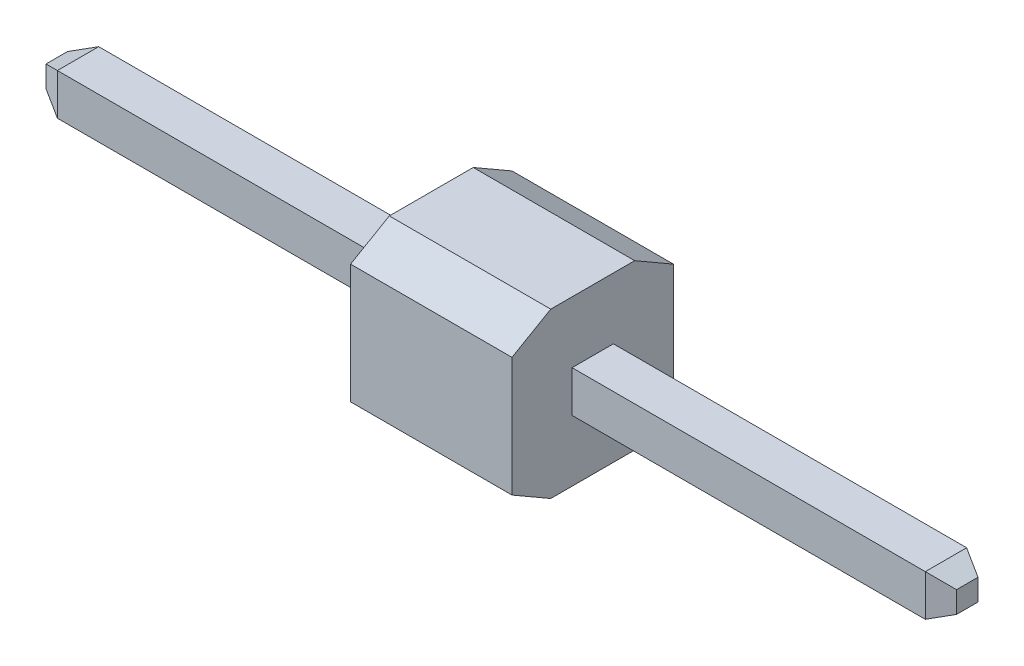
ISO-10303-21;
HEADER;
FILE_DESCRIPTION(('STEP AP214'),'2;1');
FILE_NAME('part.step','',(''),(''),'','','');
FILE_SCHEMA(('AUTOMOTIVE_DESIGN { 1 0 10303 214 1 1 1 1 }'));
ENDSEC;
DATA;
#1=APPLICATION_CONTEXT('core data for automotive mechanical design processes');
#2=APPLICATION_PROTOCOL_DEFINITION('international standard','automotive_design',2000,#1);
#3=PRODUCT_CONTEXT('',#1,'mechanical');
#4=PRODUCT('Part','Part','',(#3));
#5=PRODUCT_RELATED_PRODUCT_CATEGORY('part','',(#4));
#6=PRODUCT_DEFINITION_FORMATION('','',#4);
#7=PRODUCT_DEFINITION_CONTEXT('part definition',#1,'design');
#8=PRODUCT_DEFINITION('design','',#6,#7);
#9=PRODUCT_DEFINITION_SHAPE('','',#8);
#10=(LENGTH_UNIT() NAMED_UNIT(*) SI_UNIT(.MILLI.,.METRE.));
#11=(NAMED_UNIT(*) PLANE_ANGLE_UNIT() SI_UNIT($,.RADIAN.));
#12=(NAMED_UNIT(*) SI_UNIT($,.STERADIAN.) SOLID_ANGLE_UNIT());
#13=UNCERTAINTY_MEASURE_WITH_UNIT(LENGTH_MEASURE(1.E-05),#10,'distance_accuracy_value','');
#14=(GEOMETRIC_REPRESENTATION_CONTEXT(3) GLOBAL_UNCERTAINTY_ASSIGNED_CONTEXT((#13)) GLOBAL_UNIT_ASSIGNED_CONTEXT((#10,
#11,#12)) REPRESENTATION_CONTEXT('',''));
#15=CARTESIAN_POINT('',(0.,0.,0.));
#16=DIRECTION('',(0.,0.,1.));
#17=DIRECTION('',(1.,0.,0.));
#18=AXIS2_PLACEMENT_3D('',#15,#16,#17);
#19=CARTESIAN_POINT('',(5.42110145703109,10.4771157260571,-2.77112148378018));
#20=DIRECTION('',(1.,-9.93476518829084E-08,4.37113882867379E-08));
#21=DIRECTION('',(-9.93476589883358E-08,-1.,8.74227765734759E-08));
#22=AXIS2_PLACEMENT_3D('',#19,#20,#21);
#23=PLANE('',#22);
#24=DIRECTION('',(-1.18186619959584E-08,-0.50000007571054,-0.866025360072934));
#25=VECTOR('',#24,1.);
#26=CARTESIAN_POINT('',(5.42110126485648,9.23352602482091,-1.2011213750621));
#27=LINE('',#26,#25);
#28=CARTESIAN_POINT('',(5.42110126485648,9.23352602482091,-1.2011213750621));
#29=VERTEX_POINT('',#28);
#30=CARTESIAN_POINT('',(5.42110125666827,8.88711581085724,-1.80112134477796));
#31=VERTEX_POINT('',#30);
#32=EDGE_CURVE('E11',#29,#31,#27,.T.);
#33=ORIENTED_EDGE('',*,*,#32,.T.);
#34=DIRECTION('',(4.37113811813104E-08,-8.74227842254741E-08,-0.999999999999995));
#35=VECTOR('',#34,1.);
#36=CARTESIAN_POINT('',(5.42110125666827,8.88711581085724,-1.80112134477796));
#37=LINE('',#36,#35);
#38=CARTESIAN_POINT('',(5.42110131349307,8.88711569720762,-3.10112134477796));
#39=VERTEX_POINT('',#38);
#40=EDGE_CURVE('E304',#31,#39,#37,.T.);
#41=ORIENTED_EDGE('',*,*,#40,.T.);
#42=DIRECTION('',(8.75289950712042E-08,0.499999924289839,-0.866025447495712));
#43=VECTOR('',#42,1.);
#44=CARTESIAN_POINT('',(5.42110131349307,8.88711569720762,-3.10112134477796));
#45=LINE('',#44,#43);
#46=CARTESIAN_POINT('',(5.42110137413493,9.23352580626395,-3.7011213750621));
#47=VERTEX_POINT('',#46);
#48=EDGE_CURVE('E296',#39,#47,#45,.T.);
#49=ORIENTED_EDGE('',*,*,#48,.T.);
#50=DIRECTION('',(9.93476593244772E-08,0.999999999999991,-8.74227767226935E-08));
#51=VECTOR('',#50,1.);
#52=CARTESIAN_POINT('',(5.42110137413493,9.23352580626395,-3.7011213750621));
#53=LINE('',#52,#51);
#54=CARTESIAN_POINT('',(5.42110155764791,11.080705483234,-3.70112153654768));
#55=VERTEX_POINT('',#54);
#56=EDGE_CURVE('E281',#47,#55,#53,.T.);
#57=ORIENTED_EDGE('',*,*,#56,.T.);
#58=DIRECTION('',(-1.18186619958732E-08,-0.500000075710534,-0.866025360072937));
#59=VECTOR('',#58,1.);
#60=CARTESIAN_POINT('',(5.42110156583612,11.4271156972076,-3.10112156683181));
#61=LINE('',#60,#59);
#62=CARTESIAN_POINT('',(5.42110156583612,11.4271156972076,-3.10112156683181));
#63=VERTEX_POINT('',#62);
#64=EDGE_CURVE('E265',#63,#55,#61,.T.);
#65=ORIENTED_EDGE('',*,*,#64,.F.);
#66=DIRECTION('',(4.37113811813104E-08,-8.74227842254741E-08,-0.999999999999995));
#67=VECTOR('',#66,1.);
#68=CARTESIAN_POINT('',(5.42110150901132,11.4271158108572,-1.80112156683181));
#69=LINE('',#68,#67);
#70=CARTESIAN_POINT('',(5.42110150901132,11.4271158108572,-1.80112156683181));
#71=VERTEX_POINT('',#70);
#72=EDGE_CURVE('E248',#71,#63,#69,.T.);
#73=ORIENTED_EDGE('',*,*,#72,.F.);
#74=DIRECTION('',(8.7528995070573E-08,0.499999924289833,-0.866025447495715));
#75=VECTOR('',#74,1.);
#76=CARTESIAN_POINT('',(5.42110144836946,11.0807057017909,-1.20112153654768));
#77=LINE('',#76,#75);
#78=CARTESIAN_POINT('',(5.42110144836946,11.0807057017909,-1.20112153654768));
#79=VERTEX_POINT('',#78);
#80=EDGE_CURVE('E242',#79,#71,#77,.T.);
#81=ORIENTED_EDGE('',*,*,#80,.F.);
#82=DIRECTION('',(9.93476593244772E-08,0.999999999999991,-8.74227763620714E-08));
#83=VECTOR('',#82,1.);
#84=CARTESIAN_POINT('',(5.42110126485648,9.23352602482091,-1.2011213750621));
#85=LINE('',#84,#83);
#86=EDGE_CURVE('E236',#29,#79,#85,.T.);
#87=ORIENTED_EDGE('',*,*,#86,.F.);
#88=EDGE_LOOP('',(#33,#41,#49,#57,#65,#73,#81,#87));
#89=FACE_BOUND('',#88,.T.);
#90=DIRECTION('',(-4.37113803486431E-08,8.74227856773043E-08,0.999999999999995));
#91=VECTOR('',#90,1.);
#92=CARTESIAN_POINT('',(5.42110139344859,9.83711572605714,-2.7711214278296));
#93=LINE('',#92,#91);
#94=CARTESIAN_POINT('',(5.42110139344859,9.83711572605714,-2.7711214278296));
#95=VERTEX_POINT('',#94);
#96=CARTESIAN_POINT('',(5.4211013654733,9.83711578200772,-2.1311214278296));
#97=VERTEX_POINT('',#96);
#98=EDGE_CURVE('E302',#95,#97,#93,.T.);
#99=ORIENTED_EDGE('',*,*,#98,.T.);
#100=DIRECTION('',(-9.93476592658906E-08,-0.999999999999991,8.74227759628524E-08));
#101=VECTOR('',#100,1.);
#102=CARTESIAN_POINT('',(5.4211014290558,10.4771157820077,-2.13112148378018));
#103=LINE('',#102,#101);
#104=CARTESIAN_POINT('',(5.4211014290558,10.4771157820077,-2.13112148378018));
#105=VERTEX_POINT('',#104);
#106=EDGE_CURVE('E293',#105,#97,#103,.T.);
#107=ORIENTED_EDGE('',*,*,#106,.F.);
#108=DIRECTION('',(-4.37113803486431E-08,8.74227856773042E-08,0.999999999999995));
#109=VECTOR('',#108,1.);
#110=CARTESIAN_POINT('',(5.42110145703109,10.4771157260571,-2.77112148378018));
#111=LINE('',#110,#109);
#112=CARTESIAN_POINT('',(5.42110145703109,10.4771157260571,-2.77112148378018));
#113=VERTEX_POINT('',#112);
#114=EDGE_CURVE('E278',#113,#105,#111,.T.);
#115=ORIENTED_EDGE('',*,*,#114,.F.);
#116=DIRECTION('',(-9.93476592658906E-08,-0.999999999999991,8.74227766567418E-08));
#117=VECTOR('',#116,1.);
#118=CARTESIAN_POINT('',(5.42110145703109,10.4771157260571,-2.77112148378018));
#119=LINE('',#118,#117);
#120=EDGE_CURVE('E263',#113,#95,#119,.T.);
#121=ORIENTED_EDGE('',*,*,#120,.T.);
#122=EDGE_LOOP('',(#99,#107,#115,#121));
#123=FACE_BOUND('',#122,.T.);
#124=ADVANCED_FACE('F17',(#89,#123),#23,.T.);
#125=CARTESIAN_POINT('',(2.92110145703109,10.4771159744263,-2.77112159305865));
#126=DIRECTION('',(1.,-9.93476518829084E-08,4.37113882867379E-08));
#127=DIRECTION('',(-9.93476589883358E-08,-1.,8.74227765734759E-08));
#128=AXIS2_PLACEMENT_3D('',#125,#126,#127);
#129=PLANE('',#128);
#130=DIRECTION('',(-1.18186632779335E-08,-0.50000007571054,-0.866025360072934));
#131=VECTOR('',#130,1.);
#132=CARTESIAN_POINT('',(2.92110126485648,9.23352627319004,-1.20112148434057));
#133=LINE('',#132,#131);
#134=CARTESIAN_POINT('',(2.92110126485648,9.23352627319004,-1.20112148434057));
#135=VERTEX_POINT('',#134);
#136=CARTESIAN_POINT('',(2.92110125666827,8.88711605922637,-1.80112145405643));
#137=VERTEX_POINT('',#136);
#138=EDGE_CURVE('E24',#135,#137,#133,.T.);
#139=ORIENTED_EDGE('',*,*,#138,.F.);
#140=DIRECTION('',(9.93476588436478E-08,0.999999999999991,-8.74227763620714E-08));
#141=VECTOR('',#140,1.);
#142=CARTESIAN_POINT('',(2.92110126485648,9.23352627319004,-1.20112148434057));
#143=LINE('',#142,#141);
#144=CARTESIAN_POINT('',(2.92110144836946,11.08070595016,-1.20112164582615));
#145=VERTEX_POINT('',#144);
#146=EDGE_CURVE('E300',#135,#145,#143,.T.);
#147=ORIENTED_EDGE('',*,*,#146,.T.);
#148=DIRECTION('',(8.75289963525482E-08,0.499999924289833,-0.866025447495715));
#149=VECTOR('',#148,1.);
#150=CARTESIAN_POINT('',(2.92110144836946,11.08070595016,-1.20112164582615));
#151=LINE('',#150,#149);
#152=CARTESIAN_POINT('',(2.92110150901132,11.4271160592264,-1.80112167611028));
#153=VERTEX_POINT('',#152);
#154=EDGE_CURVE('E286',#145,#153,#151,.T.);
#155=ORIENTED_EDGE('',*,*,#154,.T.);
#156=DIRECTION('',(4.37113811813104E-08,-8.74227842254741E-08,-0.999999999999995));
#157=VECTOR('',#156,1.);
#158=CARTESIAN_POINT('',(2.92110150901132,11.4271160592264,-1.80112167611028));
#159=LINE('',#158,#157);
#160=CARTESIAN_POINT('',(2.92110156583612,11.4271159455767,-3.10112167611028));
#161=VERTEX_POINT('',#160);
#162=EDGE_CURVE('E271',#153,#161,#159,.T.);
#163=ORIENTED_EDGE('',*,*,#162,.T.);
#164=DIRECTION('',(-1.18186632778483E-08,-0.500000075710534,-0.866025360072937));
#165=VECTOR('',#164,1.);
#166=CARTESIAN_POINT('',(2.92110156583612,11.4271159455767,-3.10112167611028));
#167=LINE('',#166,#165);
#168=CARTESIAN_POINT('',(2.92110155764791,11.0807057316031,-3.70112164582615));
#169=VERTEX_POINT('',#168);
#170=EDGE_CURVE('E253',#161,#169,#167,.T.);
#171=ORIENTED_EDGE('',*,*,#170,.T.);
#172=DIRECTION('',(9.93476588436478E-08,0.999999999999991,-8.74227767226935E-08));
#173=VECTOR('',#172,1.);
#174=CARTESIAN_POINT('',(2.92110137413493,9.23352605463308,-3.70112148434057));
#175=LINE('',#174,#173);
#176=CARTESIAN_POINT('',(2.92110137413493,9.23352605463308,-3.70112148434057));
#177=VERTEX_POINT('',#176);
#178=EDGE_CURVE('E261',#177,#169,#175,.T.);
#179=ORIENTED_EDGE('',*,*,#178,.F.);
#180=DIRECTION('',(8.75289963531793E-08,0.499999924289839,-0.866025447495712));
#181=VECTOR('',#180,1.);
#182=CARTESIAN_POINT('',(2.92110131349307,8.88711594557675,-3.10112145405643));
#183=LINE('',#182,#181);
#184=CARTESIAN_POINT('',(2.92110131349307,8.88711594557675,-3.10112145405643));
#185=VERTEX_POINT('',#184);
#186=EDGE_CURVE('E276',#185,#177,#183,.T.);
#187=ORIENTED_EDGE('',*,*,#186,.F.);
#188=DIRECTION('',(4.37113811813104E-08,-8.74227842254741E-08,-0.999999999999995));
#189=VECTOR('',#188,1.);
#190=CARTESIAN_POINT('',(2.92110125666827,8.88711605922637,-1.80112145405643));
#191=LINE('',#190,#189);
#192=EDGE_CURVE('E291',#137,#185,#191,.T.);
#193=ORIENTED_EDGE('',*,*,#192,.F.);
#194=EDGE_LOOP('',(#139,#147,#155,#163,#171,#179,#187,#193));
#195=FACE_BOUND('',#194,.T.);
#196=DIRECTION('',(-9.93476585720012E-08,-0.999999999999991,8.74227759628524E-08));
#197=VECTOR('',#196,1.);
#198=CARTESIAN_POINT('',(2.9211014290558,10.4771160303769,-2.13112159305865));
#199=LINE('',#198,#197);
#200=CARTESIAN_POINT('',(2.9211014290558,10.4771160303769,-2.13112159305865));
#201=VERTEX_POINT('',#200);
#202=CARTESIAN_POINT('',(2.9211013654733,9.83711603037685,-2.13112153710807));
#203=VERTEX_POINT('',#202);
#204=EDGE_CURVE('E298',#201,#203,#199,.T.);
#205=ORIENTED_EDGE('',*,*,#204,.T.);
#206=DIRECTION('',(-4.37113810425325E-08,8.74227856773043E-08,0.999999999999995));
#207=VECTOR('',#206,1.);
#208=CARTESIAN_POINT('',(2.92110139344859,9.83711597442627,-2.77112153710807));
#209=LINE('',#208,#207);
#210=CARTESIAN_POINT('',(2.92110139344859,9.83711597442627,-2.77112153710807));
#211=VERTEX_POINT('',#210);
#212=EDGE_CURVE('E283',#211,#203,#209,.T.);
#213=ORIENTED_EDGE('',*,*,#212,.F.);
#214=DIRECTION('',(-9.93476585720012E-08,-0.999999999999991,8.74227766567418E-08));
#215=VECTOR('',#214,1.);
#216=CARTESIAN_POINT('',(2.92110145703109,10.4771159744263,-2.77112159305865));
#217=LINE('',#216,#215);
#218=CARTESIAN_POINT('',(2.92110145703109,10.4771159744263,-2.77112159305865));
#219=VERTEX_POINT('',#218);
#220=EDGE_CURVE('E268',#219,#211,#217,.T.);
#221=ORIENTED_EDGE('',*,*,#220,.F.);
#222=DIRECTION('',(-4.37113810425325E-08,8.74227856773042E-08,0.999999999999995));
#223=VECTOR('',#222,1.);
#224=CARTESIAN_POINT('',(2.92110145703109,10.4771159744263,-2.77112159305865));
#225=LINE('',#224,#223);
#226=EDGE_CURVE('E251',#219,#201,#225,.T.);
#227=ORIENTED_EDGE('',*,*,#226,.T.);
#228=EDGE_LOOP('',(#205,#213,#221,#227));
#229=FACE_BOUND('',#228,.T.);
#230=ADVANCED_FACE('F314',(#195,#229),#129,.F.);
#231=CARTESIAN_POINT('',(5.42110126485648,9.23352602482091,-1.2011213750621));
#232=DIRECTION('',(1.07893287081065E-07,0.866025360072937,-0.500000075710535));
#233=DIRECTION('',(1.18186629566715E-08,0.500000075710542,0.866025360072941));
#234=AXIS2_PLACEMENT_3D('',#231,#232,#233);
#235=PLANE('',#234);
#236=ORIENTED_EDGE('',*,*,#138,.T.);
#237=DIRECTION('',(-0.999999999999994,9.93476504618223E-08,-4.37113884643734E-08));
#238=VECTOR('',#237,1.);
#239=CARTESIAN_POINT('',(5.42110125666827,8.88711581085724,-1.80112134477796));
#240=LINE('',#239,#238);
#241=EDGE_CURVE('E288',#31,#137,#240,.T.);
#242=ORIENTED_EDGE('',*,*,#241,.F.);
#243=ORIENTED_EDGE('',*,*,#32,.F.);
#244=DIRECTION('',(-0.999999999999994,9.93476533039933E-08,-4.3711388109102E-08));
#245=VECTOR('',#244,1.);
#246=CARTESIAN_POINT('',(5.42110126485648,9.23352602482091,-1.2011213750621));
#247=LINE('',#246,#245);
#248=EDGE_CURVE('E256',#29,#135,#247,.T.);
#249=ORIENTED_EDGE('',*,*,#248,.T.);
#250=EDGE_LOOP('',(#236,#242,#243,#249));
#251=FACE_BOUND('',#250,.T.);
#252=ADVANCED_FACE('F306',(#251),#235,.F.);
#253=CARTESIAN_POINT('',(5.42110125666827,8.88711581085724,-1.80112134477796));
#254=DIRECTION('',(9.93476589883358E-08,1.,-8.74227765734759E-08));
#255=DIRECTION('',(1.,-9.93476518829084E-08,4.37113882867379E-08));
#256=AXIS2_PLACEMENT_3D('',#253,#254,#255);
#257=PLANE('',#256);
#258=ORIENTED_EDGE('',*,*,#192,.T.);
#259=DIRECTION('',(-0.999999999999994,9.93476504618223E-08,-4.37113882867377E-08));
#260=VECTOR('',#259,1.);
#261=CARTESIAN_POINT('',(5.42110131349307,8.88711569720762,-3.10112134477796));
#262=LINE('',#261,#260);
#263=EDGE_CURVE('E273',#39,#185,#262,.T.);
#264=ORIENTED_EDGE('',*,*,#263,.F.);
#265=ORIENTED_EDGE('',*,*,#40,.F.);
#266=ORIENTED_EDGE('',*,*,#241,.T.);
#267=EDGE_LOOP('',(#258,#264,#265,#266));
#268=FACE_BOUND('',#267,.T.);
#269=ADVANCED_FACE('F311',(#268),#257,.F.);
#270=CARTESIAN_POINT('',(5.42110131349307,8.88711569720762,-3.10112134477796));
#271=DIRECTION('',(6.41819058997377E-08,0.866025447495721,0.499999924289845));
#272=DIRECTION('',(-8.7528996031702E-08,-0.499999924289838,0.866025447495717));
#273=AXIS2_PLACEMENT_3D('',#270,#271,#272);
#274=PLANE('',#273);
#275=ORIENTED_EDGE('',*,*,#186,.T.);
#276=DIRECTION('',(-0.999999999999994,9.93476533039933E-08,-4.37113884643734E-08));
#277=VECTOR('',#276,1.);
#278=CARTESIAN_POINT('',(5.42110137413493,9.23352580626395,-3.7011213750621));
#279=LINE('',#278,#277);
#280=EDGE_CURVE('E258',#47,#177,#279,.T.);
#281=ORIENTED_EDGE('',*,*,#280,.F.);
#282=ORIENTED_EDGE('',*,*,#48,.F.);
#283=ORIENTED_EDGE('',*,*,#263,.T.);
#284=EDGE_LOOP('',(#275,#281,#282,#283));
#285=FACE_BOUND('',#284,.T.);
#286=ADVANCED_FACE('F319',(#285),#274,.F.);
#287=CARTESIAN_POINT('',(5.42110137413493,9.23352580626395,-3.7011213750621));
#288=DIRECTION('',(-4.37113811813106E-08,8.74227836789032E-08,1.));
#289=DIRECTION('',(-1.,9.93476518829084E-08,-4.37113882867379E-08));
#290=AXIS2_PLACEMENT_3D('',#287,#288,#289);
#291=PLANE('',#290);
#292=ORIENTED_EDGE('',*,*,#178,.T.);
#293=DIRECTION('',(-0.999999999999994,9.93476533039933E-08,-4.37113882867377E-08));
#294=VECTOR('',#293,1.);
#295=CARTESIAN_POINT('',(5.42110155764791,11.080705483234,-3.70112153654768));
#296=LINE('',#295,#294);
#297=EDGE_CURVE('E245',#55,#169,#296,.T.);
#298=ORIENTED_EDGE('',*,*,#297,.F.);
#299=ORIENTED_EDGE('',*,*,#56,.F.);
#300=ORIENTED_EDGE('',*,*,#280,.T.);
#301=EDGE_LOOP('',(#292,#298,#299,#300));
#302=FACE_BOUND('',#301,.T.);
#303=ADVANCED_FACE('F326',(#302),#291,.F.);
#304=CARTESIAN_POINT('',(5.42110156583612,11.4271156972076,-3.10112156683181));
#305=DIRECTION('',(1.07893287081065E-07,0.866025360072937,-0.500000075710535));
#306=DIRECTION('',(1.18186629566715E-08,0.500000075710542,0.866025360072941));
#307=AXIS2_PLACEMENT_3D('',#304,#305,#306);
#308=PLANE('',#307);
#309=ORIENTED_EDGE('',*,*,#170,.F.);
#310=DIRECTION('',(-0.999999999999994,9.93476533039933E-08,-4.37113884643734E-08));
#311=VECTOR('',#310,1.);
#312=CARTESIAN_POINT('',(5.42110156583612,11.4271156972076,-3.10112156683181));
#313=LINE('',#312,#311);
#314=EDGE_CURVE('E239',#63,#161,#313,.T.);
#315=ORIENTED_EDGE('',*,*,#314,.F.);
#316=ORIENTED_EDGE('',*,*,#64,.T.);
#317=ORIENTED_EDGE('',*,*,#297,.T.);
#318=EDGE_LOOP('',(#309,#315,#316,#317));
#319=FACE_BOUND('',#318,.T.);
#320=ADVANCED_FACE('F329',(#319),#308,.T.);
#321=CARTESIAN_POINT('',(5.42110150901132,11.4271158108572,-1.80112156683181));
#322=DIRECTION('',(9.93476589883358E-08,1.,-8.74227765734759E-08));
#323=DIRECTION('',(1.,-9.93476518829084E-08,4.37113882867379E-08));
#324=AXIS2_PLACEMENT_3D('',#321,#322,#323);
#325=PLANE('',#324);
#326=ORIENTED_EDGE('',*,*,#162,.F.);
#327=DIRECTION('',(-0.999999999999994,9.93476533039933E-08,-4.37113883755555E-08));
#328=VECTOR('',#327,1.);
#329=CARTESIAN_POINT('',(5.42110150901132,11.4271158108572,-1.80112156683181));
#330=LINE('',#329,#328);
#331=EDGE_CURVE('E233',#71,#153,#330,.T.);
#332=ORIENTED_EDGE('',*,*,#331,.F.);
#333=ORIENTED_EDGE('',*,*,#72,.T.);
#334=ORIENTED_EDGE('',*,*,#314,.T.);
#335=EDGE_LOOP('',(#326,#332,#333,#334));
#336=FACE_BOUND('',#335,.T.);
#337=ADVANCED_FACE('F333',(#336),#325,.T.);
#338=CARTESIAN_POINT('',(5.42110144836946,11.0807057017909,-1.20112153654768));
#339=DIRECTION('',(6.41819058997377E-08,0.866025447495721,0.499999924289845));
#340=DIRECTION('',(-8.7528996031702E-08,-0.499999924289838,0.866025447495717));
#341=AXIS2_PLACEMENT_3D('',#338,#339,#340);
#342=PLANE('',#341);
#343=ORIENTED_EDGE('',*,*,#154,.F.);
#344=DIRECTION('',(-0.999999999999994,9.93476533039933E-08,-4.3711388109102E-08));
#345=VECTOR('',#344,1.);
#346=CARTESIAN_POINT('',(5.42110144836946,11.0807057017909,-1.20112153654768));
#347=LINE('',#346,#345);
#348=EDGE_CURVE('E230',#79,#145,#347,.T.);
#349=ORIENTED_EDGE('',*,*,#348,.F.);
#350=ORIENTED_EDGE('',*,*,#80,.T.);
#351=ORIENTED_EDGE('',*,*,#331,.T.);
#352=EDGE_LOOP('',(#343,#349,#350,#351));
#353=FACE_BOUND('',#352,.T.);
#354=ADVANCED_FACE('F337',(#353),#342,.T.);
#355=CARTESIAN_POINT('',(5.42110126485648,9.23352602482091,-1.2011213750621));
#356=DIRECTION('',(-4.37113811813106E-08,8.74227835615132E-08,1.));
#357=DIRECTION('',(-9.93476589883358E-08,-1.,8.74227764560859E-08));
#358=AXIS2_PLACEMENT_3D('',#355,#356,#357);
#359=PLANE('',#358);
#360=ORIENTED_EDGE('',*,*,#146,.F.);
#361=ORIENTED_EDGE('',*,*,#248,.F.);
#362=ORIENTED_EDGE('',*,*,#86,.T.);
#363=ORIENTED_EDGE('',*,*,#348,.T.);
#364=EDGE_LOOP('',(#360,#361,#362,#363));
#365=FACE_BOUND('',#364,.T.);
#366=ADVANCED_FACE('F339',(#365),#359,.T.);
#367=CARTESIAN_POINT('',(-2.87889854296891,10.4771165506426,-2.7711218465847));
#368=DIRECTION('',(-1.,9.93476518829084E-08,-4.37113882867379E-08));
#369=DIRECTION('',(9.93476589883358E-08,1.,-8.74227765734759E-08));
#370=AXIS2_PLACEMENT_3D('',#367,#368,#369);
#371=PLANE('',#370);
#372=DIRECTION('',(9.93476608211201E-08,0.999999999999991,-8.74227774781761E-08));
#373=VECTOR('',#372,1.);
#374=CARTESIAN_POINT('',(-2.87889861251255,9.99099812033048,-2.28500333127787));
#375=LINE('',#374,#373);
#376=CARTESIAN_POINT('',(-2.87889861251255,9.99099812033048,-2.28500333127787));
#377=VERTEX_POINT('',#376);
#378=CARTESIAN_POINT('',(-2.87889857950559,10.3232350659405,-2.28500336032295));
#379=VERTEX_POINT('',#378);
#380=EDGE_CURVE('E228',#377,#379,#375,.T.);
#381=ORIENTED_EDGE('',*,*,#380,.T.);
#382=DIRECTION('',(4.37113820547149E-08,-8.7422774802743E-08,-0.999999999999995));
#383=VECTOR('',#382,1.);
#384=CARTESIAN_POINT('',(-2.87889857950559,10.3232350659405,-2.28500336032295));
#385=LINE('',#384,#383);
#386=CARTESIAN_POINT('',(-2.87889856498306,10.3232350368954,-2.61724030594095));
#387=VERTEX_POINT('',#386);
#388=EDGE_CURVE('E223',#379,#387,#385,.T.);
#389=ORIENTED_EDGE('',*,*,#388,.T.);
#390=DIRECTION('',(-9.93476608211201E-08,-0.999999999999991,8.7422776141512E-08));
#391=VECTOR('',#390,1.);
#392=CARTESIAN_POINT('',(-2.87889856498305,10.3232350368954,-2.61724030594095));
#393=LINE('',#392,#391);
#394=CARTESIAN_POINT('',(-2.87889859799002,9.9909980912854,-2.61724027689587));
#395=VERTEX_POINT('',#394);
#396=EDGE_CURVE('E215',#387,#395,#393,.T.);
#397=ORIENTED_EDGE('',*,*,#396,.T.);
#398=DIRECTION('',(-4.37113767080583E-08,8.74227854960559E-08,0.999999999999995));
#399=VECTOR('',#398,1.);
#400=CARTESIAN_POINT('',(-2.87889859799002,9.9909980912854,-2.61724027689587));
#401=LINE('',#400,#399);
#402=EDGE_CURVE('E207',#395,#377,#401,.T.);
#403=ORIENTED_EDGE('',*,*,#402,.T.);
#404=EDGE_LOOP('',(#381,#389,#397,#403));
#405=FACE_BOUND('',#404,.T.);
#406=ADVANCED_FACE('F341',(#405),#371,.T.);
#407=CARTESIAN_POINT('',(-2.87889854296891,10.4771165506426,-2.7711218465847));
#408=DIRECTION('',(9.93476589883358E-08,1.,-8.74227764510112E-08));
#409=DIRECTION('',(-4.37113811813106E-08,8.74227835564385E-08,1.));
#410=AXIS2_PLACEMENT_3D('',#407,#408,#409);
#411=PLANE('',#410);
#412=DIRECTION('',(0.999999999999994,-9.93476521037346E-08,4.37113882769953E-08));
#413=VECTOR('',#412,1.);
#414=CARTESIAN_POINT('',(-2.54889854296891,10.4771165178579,-2.77112183215994));
#415=LINE('',#414,#413);
#416=CARTESIAN_POINT('',(-2.54889854296891,10.4771165178579,-2.77112183215994));
#417=VERTEX_POINT('',#416);
#418=EDGE_CURVE('E225',#417,#219,#415,.T.);
#419=ORIENTED_EDGE('',*,*,#418,.F.);
#420=DIRECTION('',(-4.37113803486431E-08,8.74227856773042E-08,0.999999999999995));
#421=VECTOR('',#420,1.);
#422=CARTESIAN_POINT('',(-2.54889854296891,10.4771165178579,-2.77112183215994));
#423=LINE('',#422,#421);
#424=CARTESIAN_POINT('',(-2.5488985709442,10.4771165738085,-2.13112183215994));
#425=VERTEX_POINT('',#424);
#426=EDGE_CURVE('E217',#417,#425,#423,.T.);
#427=ORIENTED_EDGE('',*,*,#426,.T.);
#428=DIRECTION('',(0.999999999999994,-9.93476521037346E-08,4.3711388195809E-08));
#429=VECTOR('',#428,1.);
#430=CARTESIAN_POINT('',(-2.5488985709442,10.4771165738085,-2.13112183215994));
#431=LINE('',#430,#429);
#432=EDGE_CURVE('E220',#425,#201,#431,.T.);
#433=ORIENTED_EDGE('',*,*,#432,.T.);
#434=ORIENTED_EDGE('',*,*,#226,.F.);
#435=EDGE_LOOP('',(#419,#427,#433,#434));
#436=FACE_BOUND('',#435,.T.);
#437=ADVANCED_FACE('F348',(#436),#411,.T.);
#438=CARTESIAN_POINT('',(-2.8788985709442,10.4771166065932,-2.1311218465847));
#439=DIRECTION('',(-4.37113811813106E-08,8.74227836789032E-08,1.));
#440=DIRECTION('',(-1.,9.93476518829084E-08,-4.37113882867379E-08));
#441=AXIS2_PLACEMENT_3D('',#438,#439,#440);
#442=PLANE('',#441);
#443=ORIENTED_EDGE('',*,*,#432,.F.);
#444=DIRECTION('',(-9.93476592658906E-08,-0.999999999999991,8.74227766567418E-08));
#445=VECTOR('',#444,1.);
#446=CARTESIAN_POINT('',(-2.5488985709442,10.4771165738085,-2.13112183215994));
#447=LINE('',#446,#445);
#448=CARTESIAN_POINT('',(-2.5488986345267,9.83711657380851,-2.13112177620936));
#449=VERTEX_POINT('',#448);
#450=EDGE_CURVE('E209',#425,#449,#447,.T.);
#451=ORIENTED_EDGE('',*,*,#450,.T.);
#452=DIRECTION('',(0.999999999999994,-9.93476547016971E-08,4.3711388195809E-08));
#453=VECTOR('',#452,1.);
#454=CARTESIAN_POINT('',(-2.5488986345267,9.83711657380851,-2.13112177620936));
#455=LINE('',#454,#453);
#456=EDGE_CURVE('E212',#449,#203,#455,.T.);
#457=ORIENTED_EDGE('',*,*,#456,.T.);
#458=ORIENTED_EDGE('',*,*,#204,.F.);
#459=EDGE_LOOP('',(#443,#451,#457,#458));
#460=FACE_BOUND('',#459,.T.);
#461=ADVANCED_FACE('F424',(#460),#442,.T.);
#462=CARTESIAN_POINT('',(-2.87889860655141,9.83711655064265,-2.77112179063412));
#463=DIRECTION('',(9.93476589883357E-08,1.,-8.74227764040693E-08));
#464=DIRECTION('',(-4.37113811813106E-08,8.74227835094966E-08,1.));
#465=AXIS2_PLACEMENT_3D('',#462,#463,#464);
#466=PLANE('',#465);
#467=ORIENTED_EDGE('',*,*,#456,.F.);
#468=DIRECTION('',(4.37113817364219E-08,-8.74227967795345E-08,-0.999999999999995));
#469=VECTOR('',#468,1.);
#470=CARTESIAN_POINT('',(-2.5488986345267,9.83711657380852,-2.13112177620936));
#471=LINE('',#470,#469);
#472=CARTESIAN_POINT('',(-2.54889860655141,9.83711651785792,-2.77112177620936));
#473=VERTEX_POINT('',#472);
#474=EDGE_CURVE('E201',#449,#473,#471,.T.);
#475=ORIENTED_EDGE('',*,*,#474,.T.);
#476=DIRECTION('',(0.999999999999994,-9.93476547016971E-08,4.37113882769953E-08));
#477=VECTOR('',#476,1.);
#478=CARTESIAN_POINT('',(-2.54889860655141,9.83711651785792,-2.77112177620936));
#479=LINE('',#478,#477);
#480=EDGE_CURVE('E204',#473,#211,#479,.T.);
#481=ORIENTED_EDGE('',*,*,#480,.T.);
#482=ORIENTED_EDGE('',*,*,#212,.T.);
#483=EDGE_LOOP('',(#467,#475,#481,#482));
#484=FACE_BOUND('',#483,.T.);
#485=ADVANCED_FACE('F421',(#484),#466,.F.);
#486=CARTESIAN_POINT('',(-2.87889854296891,10.4771165506426,-2.7711218465847));
#487=DIRECTION('',(-4.37113811813106E-08,8.74227836789032E-08,1.));
#488=DIRECTION('',(-1.,9.93476518829084E-08,-4.37113882867379E-08));
#489=AXIS2_PLACEMENT_3D('',#486,#487,#488);
#490=PLANE('',#489);
#491=ORIENTED_EDGE('',*,*,#480,.F.);
#492=DIRECTION('',(9.93476578781123E-08,0.999999999999991,-8.74227766567422E-08));
#493=VECTOR('',#492,1.);
#494=CARTESIAN_POINT('',(-2.54889860655141,9.83711651785793,-2.77112177620936));
#495=LINE('',#494,#493);
#496=EDGE_CURVE('E196',#473,#417,#495,.T.);
#497=ORIENTED_EDGE('',*,*,#496,.T.);
#498=ORIENTED_EDGE('',*,*,#418,.T.);
#499=ORIENTED_EDGE('',*,*,#220,.T.);
#500=EDGE_LOOP('',(#491,#497,#498,#499));
#501=FACE_BOUND('',#500,.T.);
#502=ADVANCED_FACE('F376',(#501),#490,.F.);
#503=CARTESIAN_POINT('',(-2.87889854296891,10.4771165506426,-2.7711218465847));
#504=DIRECTION('',(-4.37113811813106E-08,8.74227836789032E-08,1.));
#505=DIRECTION('',(-1.,9.93476518829084E-08,-4.37113882867379E-08));
#506=AXIS2_PLACEMENT_3D('',#503,#504,#505);
#507=PLANE('',#506);
#508=DIRECTION('',(0.999999999999994,-9.93476469078097E-08,4.37113882769953E-08));
#509=VECTOR('',#508,1.);
#510=CARTESIAN_POINT('',(5.42110145703109,10.4771157260571,-2.77112148378018));
#511=LINE('',#510,#509);
#512=CARTESIAN_POINT('',(10.8911014570311,10.4771151826255,-2.77112124467888));
#513=VERTEX_POINT('',#512);
#514=EDGE_CURVE('E199',#113,#513,#511,.T.);
#515=ORIENTED_EDGE('',*,*,#514,.T.);
#516=DIRECTION('',(-9.93476606536693E-08,-0.999999999999991,8.74227766567418E-08));
#517=VECTOR('',#516,1.);
#518=CARTESIAN_POINT('',(10.8911014570311,10.4771151826255,-2.77112124467888));
#519=LINE('',#518,#517);
#520=CARTESIAN_POINT('',(10.8911013934486,9.83711518262548,-2.77112118872831));
#521=VERTEX_POINT('',#520);
#522=EDGE_CURVE('E191',#513,#521,#519,.T.);
#523=ORIENTED_EDGE('',*,*,#522,.T.);
#524=DIRECTION('',(0.999999999999994,-9.93476572996596E-08,4.37113882769953E-08));
#525=VECTOR('',#524,1.);
#526=CARTESIAN_POINT('',(5.42110139344859,9.83711572605714,-2.7711214278296));
#527=LINE('',#526,#525);
#528=EDGE_CURVE('E194',#95,#521,#527,.T.);
#529=ORIENTED_EDGE('',*,*,#528,.F.);
#530=ORIENTED_EDGE('',*,*,#120,.F.);
#531=EDGE_LOOP('',(#515,#523,#529,#530));
#532=FACE_BOUND('',#531,.T.);
#533=ADVANCED_FACE('F367',(#532),#507,.F.);
#534=CARTESIAN_POINT('',(-2.87889860655141,9.83711655064265,-2.77112179063412));
#535=DIRECTION('',(9.93476589883357E-08,1.,-8.74227764040693E-08));
#536=DIRECTION('',(-4.37113811813106E-08,8.74227835094966E-08,1.));
#537=AXIS2_PLACEMENT_3D('',#534,#535,#536);
#538=PLANE('',#537);
#539=ORIENTED_EDGE('',*,*,#528,.T.);
#540=DIRECTION('',(-4.37113845119794E-08,8.74227856773042E-08,0.999999999999995));
#541=VECTOR('',#540,1.);
#542=CARTESIAN_POINT('',(10.8911013934486,9.83711518262548,-2.77112118872831));
#543=LINE('',#542,#541);
#544=CARTESIAN_POINT('',(10.8911013654733,9.83711523857606,-2.13112118872831));
#545=VERTEX_POINT('',#544);
#546=EDGE_CURVE('E186',#521,#545,#543,.T.);
#547=ORIENTED_EDGE('',*,*,#546,.T.);
#548=DIRECTION('',(0.999999999999994,-9.93476572996596E-08,4.37113881146227E-08));
#549=VECTOR('',#548,1.);
#550=CARTESIAN_POINT('',(5.4211013654733,9.83711578200772,-2.1311214278296));
#551=LINE('',#550,#549);
#552=EDGE_CURVE('E189',#97,#545,#551,.T.);
#553=ORIENTED_EDGE('',*,*,#552,.F.);
#554=ORIENTED_EDGE('',*,*,#98,.F.);
#555=EDGE_LOOP('',(#539,#547,#553,#554));
#556=FACE_BOUND('',#555,.T.);
#557=ADVANCED_FACE('F364',(#556),#538,.F.);
#558=CARTESIAN_POINT('',(-2.8788985709442,10.4771166065932,-2.1311218465847));
#559=DIRECTION('',(-4.37113811813106E-08,8.74227836789032E-08,1.));
#560=DIRECTION('',(-1.,9.93476518829084E-08,-4.37113882867379E-08));
#561=AXIS2_PLACEMENT_3D('',#558,#559,#560);
#562=PLANE('',#561);
#563=ORIENTED_EDGE('',*,*,#552,.T.);
#564=DIRECTION('',(9.93476606536699E-08,0.999999999999991,-8.74227759628529E-08));
#565=VECTOR('',#564,1.);
#566=CARTESIAN_POINT('',(10.8911013654733,9.83711523857607,-2.13112118872831));
#567=LINE('',#566,#565);
#568=CARTESIAN_POINT('',(10.8911014290558,10.4771152385761,-2.13112124467888));
#569=VERTEX_POINT('',#568);
#570=EDGE_CURVE('E176',#545,#569,#567,.T.);
#571=ORIENTED_EDGE('',*,*,#570,.T.);
#572=DIRECTION('',(0.999999999999994,-9.93476469078097E-08,4.37113881146227E-08));
#573=VECTOR('',#572,1.);
#574=CARTESIAN_POINT('',(5.4211014290558,10.4771157820077,-2.13112148378018));
#575=LINE('',#574,#573);
#576=EDGE_CURVE('E179',#105,#569,#575,.T.);
#577=ORIENTED_EDGE('',*,*,#576,.F.);
#578=ORIENTED_EDGE('',*,*,#106,.T.);
#579=EDGE_LOOP('',(#563,#571,#577,#578));
#580=FACE_BOUND('',#579,.T.);
#581=ADVANCED_FACE('F366',(#580),#562,.T.);
#582=CARTESIAN_POINT('',(-2.87889854296891,10.4771165506426,-2.7711218465847));
#583=DIRECTION('',(9.93476589883358E-08,1.,-8.74227764510112E-08));
#584=DIRECTION('',(-4.37113811813106E-08,8.74227835564385E-08,1.));
#585=AXIS2_PLACEMENT_3D('',#582,#583,#584);
#586=PLANE('',#585);
#587=ORIENTED_EDGE('',*,*,#576,.T.);
#588=DIRECTION('',(4.37113789608643E-08,-8.74227856773042E-08,-0.999999999999995));
#589=VECTOR('',#588,1.);
#590=CARTESIAN_POINT('',(10.8911014290558,10.4771152385761,-2.13112124467888));
#591=LINE('',#590,#589);
#592=EDGE_CURVE('E167',#569,#513,#591,.T.);
#593=ORIENTED_EDGE('',*,*,#592,.T.);
#594=ORIENTED_EDGE('',*,*,#514,.F.);
#595=ORIENTED_EDGE('',*,*,#114,.T.);
#596=EDGE_LOOP('',(#587,#593,#594,#595));
#597=FACE_BOUND('',#596,.T.);
#598=ADVANCED_FACE('F373',(#597),#586,.T.);
#599=CARTESIAN_POINT('',(11.2211014570311,10.4771151498408,-2.77112123025412));
#600=DIRECTION('',(-1.,9.93476518829084E-08,-4.37113882867379E-08));
#601=DIRECTION('',(9.93476589883358E-08,1.,-8.74227765734759E-08));
#602=AXIS2_PLACEMENT_3D('',#599,#600,#601);
#603=PLANE('',#602);
#604=DIRECTION('',(-9.93476581477919E-08,-0.999999999999991,8.7422776141512E-08));
#605=VECTOR('',#604,1.);
#606=CARTESIAN_POINT('',(11.2211014204944,10.3232336651386,-2.28500274399237));
#607=LINE('',#606,#605);
#608=CARTESIAN_POINT('',(11.2211014204944,10.3232336651386,-2.28500274399237));
#609=VERTEX_POINT('',#608);
#610=CARTESIAN_POINT('',(11.2211013874874,9.99099671952859,-2.2850027149473));
#611=VERTEX_POINT('',#610);
#612=EDGE_CURVE('E153',#609,#611,#607,.T.);
#613=ORIENTED_EDGE('',*,*,#612,.T.);
#614=DIRECTION('',(4.37113767080584E-08,-8.74228068826822E-08,-0.999999999999995));
#615=VECTOR('',#614,1.);
#616=CARTESIAN_POINT('',(11.2211013874874,9.9909967195286,-2.2850027149473));
#617=LINE('',#616,#615);
#618=CARTESIAN_POINT('',(11.22110140201,9.99099669048351,-2.6172396605653));
#619=VERTEX_POINT('',#618);
#620=EDGE_CURVE('E395',#611,#619,#617,.T.);
#621=ORIENTED_EDGE('',*,*,#620,.T.);
#622=DIRECTION('',(9.93476581477919E-08,0.999999999999991,-8.7422776141512E-08));
#623=VECTOR('',#622,1.);
#624=CARTESIAN_POINT('',(11.22110140201,9.99099669048351,-2.6172396605653));
#625=LINE('',#624,#623);
#626=CARTESIAN_POINT('',(11.2211014350169,10.3232336360935,-2.61723968961037));
#627=VERTEX_POINT('',#626);
#628=EDGE_CURVE('E156',#619,#627,#625,.T.);
#629=ORIENTED_EDGE('',*,*,#628,.T.);
#630=DIRECTION('',(-4.37113820547149E-08,8.7422774802743E-08,0.999999999999995));
#631=VECTOR('',#630,1.);
#632=CARTESIAN_POINT('',(11.2211014350169,10.3232336360935,-2.61723968961037));
#633=LINE('',#632,#631);
#634=EDGE_CURVE('E149',#627,#609,#633,.T.);
#635=ORIENTED_EDGE('',*,*,#634,.T.);
#636=EDGE_LOOP('',(#613,#621,#629,#635));
#637=FACE_BOUND('',#636,.T.);
#638=ADVANCED_FACE('F151',(#637),#603,.F.);
#639=CARTESIAN_POINT('',(-2.87889859126364,9.99099807783265,-2.77112180408687));
#640=DIRECTION('',(-0.422618351780369,-0.906307745050466,6.07587120833484E-08));
#641=DIRECTION('',(4.37113811813106E-08,-8.74227835094966E-08,-1.));
#642=AXIS2_PLACEMENT_3D('',#639,#640,#641);
#643=PLANE('',#642);
#644=DIRECTION('',(0.834817073788752,-0.389281669540032,0.3892816911581));
#645=VECTOR('',#644,1.);
#646=CARTESIAN_POINT('',(-2.87889861251257,9.99099812032996,-2.28500333127836));
#647=LINE('',#646,#645);
#648=EDGE_CURVE('E181',#377,#449,#647,.T.);
#649=ORIENTED_EDGE('',*,*,#648,.F.);
#650=ORIENTED_EDGE('',*,*,#402,.F.);
#651=DIRECTION('',(-0.834817107820826,0.389281737604198,0.389281550111906));
#652=VECTOR('',#651,1.);
#653=CARTESIAN_POINT('',(-2.54889860655184,9.83711651785646,-2.77112177620883));
#654=LINE('',#653,#652);
#655=EDGE_CURVE('E404',#473,#395,#654,.T.);
#656=ORIENTED_EDGE('',*,*,#655,.F.);
#657=ORIENTED_EDGE('',*,*,#474,.F.);
#658=EDGE_LOOP('',(#649,#650,#656,#657));
#659=FACE_BOUND('',#658,.T.);
#660=ADVANCED_FACE('F418',(#659),#643,.T.);
#661=CARTESIAN_POINT('',(-2.87889854969529,10.4771165640954,-2.6172403193937));
#662=DIRECTION('',(-0.422618222124847,-3.72458176658199E-08,-0.906307805509828));
#663=DIRECTION('',(9.93476589883358E-08,1.,-8.74227765734759E-08));
#664=AXIS2_PLACEMENT_3D('',#661,#662,#663);
#665=PLANE('',#664);
#666=ORIENTED_EDGE('',*,*,#655,.T.);
#667=ORIENTED_EDGE('',*,*,#396,.F.);
#668=DIRECTION('',(-0.834817185169254,-0.389281503665803,0.389281618176064));
#669=VECTOR('',#668,1.);
#670=CARTESIAN_POINT('',(-2.54889854296777,10.4771165178552,-2.77112183216021));
#671=LINE('',#670,#669);
#672=EDGE_CURVE('E160',#417,#387,#671,.T.);
#673=ORIENTED_EDGE('',*,*,#672,.F.);
#674=ORIENTED_EDGE('',*,*,#496,.F.);
#675=EDGE_LOOP('',(#666,#667,#673,#674));
#676=FACE_BOUND('',#675,.T.);
#677=ADVANCED_FACE('F434',(#676),#665,.T.);
#678=CARTESIAN_POINT('',(-2.5488985709442,10.4771165738085,-2.13112183215994));
#679=DIRECTION('',(0.422618301356777,-1.21218081559392E-07,-0.906307768563367));
#680=DIRECTION('',(-9.93476589883358E-08,-1.,8.74227765734759E-08));
#681=AXIS2_PLACEMENT_3D('',#678,#679,#680);
#682=PLANE('',#681);
#683=ORIENTED_EDGE('',*,*,#648,.T.);
#684=ORIENTED_EDGE('',*,*,#450,.F.);
#685=DIRECTION('',(0.83481715113718,0.38928157172997,0.389281623093934));
#686=VECTOR('',#685,1.);
#687=CARTESIAN_POINT('',(-2.87889857950843,10.323235065948,-2.28500336032441));
#688=LINE('',#687,#686);
#689=EDGE_CURVE('E170',#379,#425,#688,.T.);
#690=ORIENTED_EDGE('',*,*,#689,.F.);
#691=ORIENTED_EDGE('',*,*,#380,.F.);
#692=EDGE_LOOP('',(#683,#684,#690,#691));
#693=FACE_BOUND('',#692,.T.);
#694=ADVANCED_FACE('F413',(#693),#682,.F.);
#695=CARTESIAN_POINT('',(-2.54889854296891,10.4771165178579,-2.77112183215994));
#696=DIRECTION('',(0.422618171701255,-0.906307829022729,9.770517399793E-08));
#697=DIRECTION('',(-4.37113811813106E-08,8.74227835564385E-08,1.));
#698=AXIS2_PLACEMENT_3D('',#695,#696,#697);
#699=PLANE('',#698);
#700=ORIENTED_EDGE('',*,*,#672,.T.);
#701=ORIENTED_EDGE('',*,*,#388,.F.);
#702=ORIENTED_EDGE('',*,*,#689,.T.);
#703=ORIENTED_EDGE('',*,*,#426,.F.);
#704=EDGE_LOOP('',(#700,#701,#702,#703));
#705=FACE_BOUND('',#704,.T.);
#706=ADVANCED_FACE('F429',(#705),#699,.F.);
#707=CARTESIAN_POINT('',(11.2211014417433,10.3232336226408,-2.77112121680137));
#708=DIRECTION('',(0.422618351780369,0.906307745050466,-6.07587121258922E-08));
#709=DIRECTION('',(4.37113811813106E-08,-8.74227835564385E-08,-1.));
#710=AXIS2_PLACEMENT_3D('',#707,#708,#709);
#711=PLANE('',#710);
#712=DIRECTION('',(-0.834817107820823,0.389281737604203,0.389281550111907));
#713=VECTOR('',#712,1.);
#714=CARTESIAN_POINT('',(11.2211014204944,10.3232336651391,-2.28500274399286));
#715=LINE('',#714,#713);
#716=EDGE_CURVE('E164',#609,#569,#715,.T.);
#717=ORIENTED_EDGE('',*,*,#716,.F.);
#718=ORIENTED_EDGE('',*,*,#634,.F.);
#719=DIRECTION('',(0.834817073788751,-0.389281669540036,0.389281691158099));
#720=VECTOR('',#719,1.);
#721=CARTESIAN_POINT('',(10.8911014570311,10.4771151826255,-2.77112124467888));
#722=LINE('',#721,#720);
#723=EDGE_CURVE('E392',#513,#627,#722,.T.);
#724=ORIENTED_EDGE('',*,*,#723,.F.);
#725=ORIENTED_EDGE('',*,*,#592,.F.);
#726=EDGE_LOOP('',(#717,#718,#724,#725));
#727=FACE_BOUND('',#726,.T.);
#728=ADVANCED_FACE('F165',(#727),#711,.T.);
#729=CARTESIAN_POINT('',(10.8911014570311,10.4771151826255,-2.77112124467888));
#730=DIRECTION('',(-0.422618301356777,1.21218081559392E-07,0.906307768563367));
#731=DIRECTION('',(-9.93476589883358E-08,-1.,8.74227765734759E-08));
#732=AXIS2_PLACEMENT_3D('',#729,#730,#731);
#733=PLANE('',#732);
#734=ORIENTED_EDGE('',*,*,#723,.T.);
#735=ORIENTED_EDGE('',*,*,#628,.F.);
#736=DIRECTION('',(0.834817151137177,0.389281571729974,0.389281623093935));
#737=VECTOR('',#736,1.);
#738=CARTESIAN_POINT('',(10.8911013934501,9.83711518262128,-2.7711211887274));
#739=LINE('',#738,#737);
#740=EDGE_CURVE('E389',#521,#619,#739,.T.);
#741=ORIENTED_EDGE('',*,*,#740,.F.);
#742=ORIENTED_EDGE('',*,*,#522,.F.);
#743=EDGE_LOOP('',(#734,#735,#741,#742));
#744=FACE_BOUND('',#743,.T.);
#745=ADVANCED_FACE('F390',(#744),#733,.F.);
#746=CARTESIAN_POINT('',(11.2211014357822,10.4771151923386,-2.28500275744512));
#747=DIRECTION('',(0.422618222124847,3.72458176658199E-08,0.906307805509828));
#748=DIRECTION('',(9.93476589883358E-08,1.,-8.74227765734759E-08));
#749=AXIS2_PLACEMENT_3D('',#746,#747,#748);
#750=PLANE('',#749);
#751=ORIENTED_EDGE('',*,*,#716,.T.);
#752=ORIENTED_EDGE('',*,*,#570,.F.);
#753=DIRECTION('',(-0.834817185169255,-0.389281503665799,0.389281618176066));
#754=VECTOR('',#753,1.);
#755=CARTESIAN_POINT('',(11.2211013874875,9.99099671952807,-2.28500271494778));
#756=LINE('',#755,#754);
#757=EDGE_CURVE('E175',#611,#545,#756,.T.);
#758=ORIENTED_EDGE('',*,*,#757,.F.);
#759=ORIENTED_EDGE('',*,*,#612,.F.);
#760=EDGE_LOOP('',(#751,#752,#758,#759));
#761=FACE_BOUND('',#760,.T.);
#762=ADVANCED_FACE('F173',(#761),#750,.T.);
#763=CARTESIAN_POINT('',(10.8911013934486,9.83711518262548,-2.77112118872831));
#764=DIRECTION('',(-0.422618171701255,0.906307829022729,-9.77051739553862E-08));
#765=DIRECTION('',(-4.37113811813106E-08,8.74227835094966E-08,1.));
#766=AXIS2_PLACEMENT_3D('',#763,#764,#765);
#767=PLANE('',#766);
#768=ORIENTED_EDGE('',*,*,#740,.T.);
#769=ORIENTED_EDGE('',*,*,#620,.F.);
#770=ORIENTED_EDGE('',*,*,#757,.T.);
#771=ORIENTED_EDGE('',*,*,#546,.F.);
#772=EDGE_LOOP('',(#768,#769,#770,#771));
#773=FACE_BOUND('',#772,.T.);
#774=ADVANCED_FACE('F394',(#773),#767,.F.);
#775=CLOSED_SHELL('',(#124,#230,#252,#269,#286,#303,#320,#337,#354,#366,#406,#437,#461,#485,
#502,#533,#557,#581,#598,#638,#660,#677,#694,#706,#728,#745,#762,#774));
#776=MANIFOLD_SOLID_BREP('B1',#775);
#777=ADVANCED_BREP_SHAPE_REPRESENTATION('',(#18,#776),#14);
#778=SHAPE_DEFINITION_REPRESENTATION(#9,#777);
ENDSEC;
END-ISO-10303-21;
